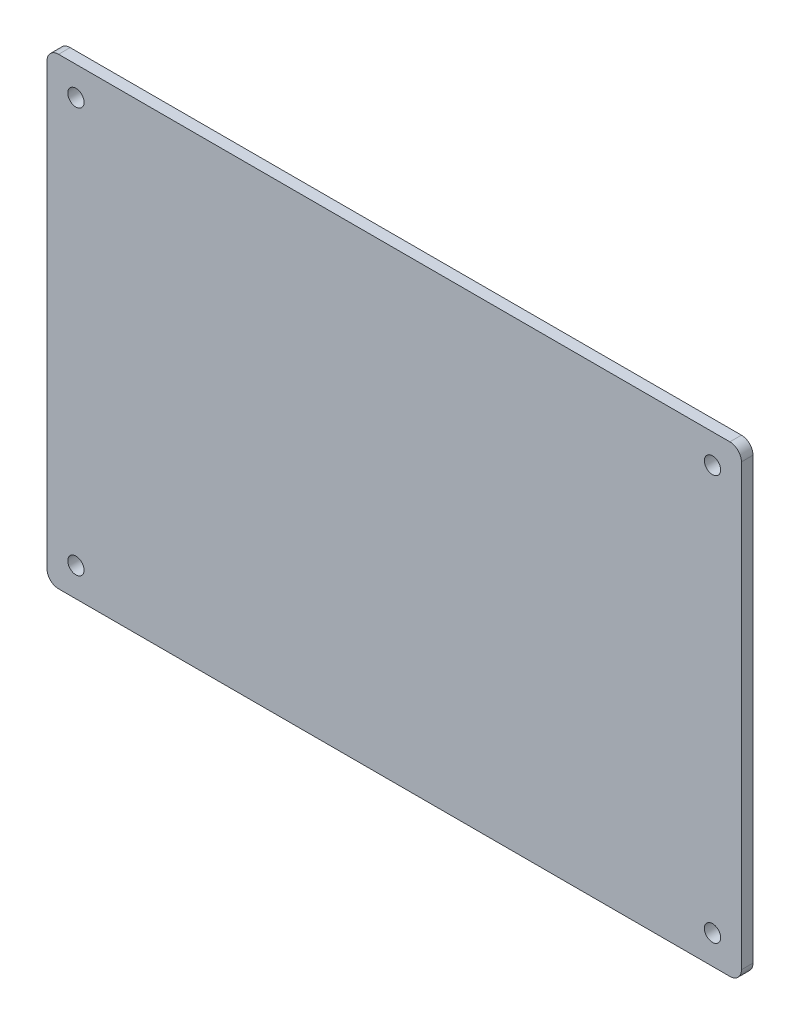
ISO-10303-21;
HEADER;
FILE_DESCRIPTION(('STEP AP214'),'2;1');
FILE_NAME('part.step','',(''),(''),'','','');
FILE_SCHEMA(('AUTOMOTIVE_DESIGN { 1 0 10303 214 1 1 1 1 }'));
ENDSEC;
DATA;
#1=APPLICATION_CONTEXT('core data for automotive mechanical design processes');
#2=APPLICATION_PROTOCOL_DEFINITION('international standard','automotive_design',2000,#1);
#3=PRODUCT_CONTEXT('',#1,'mechanical');
#4=PRODUCT('Part','Part','',(#3));
#5=PRODUCT_RELATED_PRODUCT_CATEGORY('part','',(#4));
#6=PRODUCT_DEFINITION_FORMATION('','',#4);
#7=PRODUCT_DEFINITION_CONTEXT('part definition',#1,'design');
#8=PRODUCT_DEFINITION('design','',#6,#7);
#9=PRODUCT_DEFINITION_SHAPE('','',#8);
#10=(LENGTH_UNIT() NAMED_UNIT(*) SI_UNIT(.MILLI.,.METRE.));
#11=(NAMED_UNIT(*) PLANE_ANGLE_UNIT() SI_UNIT($,.RADIAN.));
#12=(NAMED_UNIT(*) SI_UNIT($,.STERADIAN.) SOLID_ANGLE_UNIT());
#13=UNCERTAINTY_MEASURE_WITH_UNIT(LENGTH_MEASURE(1.E-05),#10,'distance_accuracy_value','');
#14=(GEOMETRIC_REPRESENTATION_CONTEXT(3) GLOBAL_UNCERTAINTY_ASSIGNED_CONTEXT((#13)) GLOBAL_UNIT_ASSIGNED_CONTEXT((#10,
#11,#12)) REPRESENTATION_CONTEXT('',''));
#15=CARTESIAN_POINT('',(0.,0.,0.));
#16=DIRECTION('',(0.,0.,1.));
#17=DIRECTION('',(1.,0.,0.));
#18=AXIS2_PLACEMENT_3D('',#15,#16,#17);
#19=CARTESIAN_POINT('',(0.,0.,2.));
#20=DIRECTION('',(0.,0.,-1.));
#21=DIRECTION('',(-1.,0.,0.));
#22=AXIS2_PLACEMENT_3D('',#19,#20,#21);
#23=PLANE('',#22);
#24=CARTESIAN_POINT('',(115.,75.,2.));
#25=DIRECTION('',(0.,0.,-1.));
#26=DIRECTION('',(-1.,0.,0.));
#27=AXIS2_PLACEMENT_3D('',#24,#25,#26);
#28=CIRCLE('',#27,1.40734065524881);
#29=CARTESIAN_POINT('',(113.592659344751,75.,2.));
#30=VERTEX_POINT('',#29);
#31=EDGE_CURVE('E189',#30,#30,#28,.T.);
#32=ORIENTED_EDGE('',*,*,#31,.T.);
#33=EDGE_LOOP('',(#32));
#34=FACE_BOUND('',#33,.T.);
#35=CARTESIAN_POINT('',(5.,5.,2.));
#36=DIRECTION('',(0.,0.,-1.));
#37=DIRECTION('',(-1.,0.,0.));
#38=AXIS2_PLACEMENT_3D('',#35,#36,#37);
#39=CIRCLE('',#38,1.4073406552488);
#40=CARTESIAN_POINT('',(3.5926593447512,5.,2.));
#41=VERTEX_POINT('',#40);
#42=EDGE_CURVE('E192',#41,#41,#39,.T.);
#43=ORIENTED_EDGE('',*,*,#42,.T.);
#44=EDGE_LOOP('',(#43));
#45=FACE_BOUND('',#44,.T.);
#46=CARTESIAN_POINT('',(115.,5.,2.));
#47=DIRECTION('',(0.,0.,1.));
#48=DIRECTION('',(1.,0.,0.));
#49=AXIS2_PLACEMENT_3D('',#46,#47,#48);
#50=CIRCLE('',#49,1.40734065524881);
#51=CARTESIAN_POINT('',(116.407340655249,5.,2.));
#52=VERTEX_POINT('',#51);
#53=EDGE_CURVE('E132',#52,#52,#50,.T.);
#54=ORIENTED_EDGE('',*,*,#53,.F.);
#55=EDGE_LOOP('',(#54));
#56=FACE_BOUND('',#55,.T.);
#57=DIRECTION('',(1.,0.,0.));
#58=VECTOR('',#57,1.);
#59=CARTESIAN_POINT('',(0.,0.,2.));
#60=LINE('',#59,#58);
#61=CARTESIAN_POINT('',(2.,0.,2.));
#62=VERTEX_POINT('',#61);
#63=CARTESIAN_POINT('',(118.,0.,2.));
#64=VERTEX_POINT('',#63);
#65=EDGE_CURVE('E119',#62,#64,#60,.T.);
#66=ORIENTED_EDGE('',*,*,#65,.T.);
#67=CARTESIAN_POINT('',(118.,2.,2.));
#68=DIRECTION('',(0.,0.,-1.));
#69=DIRECTION('',(-1.,0.,0.));
#70=AXIS2_PLACEMENT_3D('',#67,#68,#69);
#71=CIRCLE('',#70,2.);
#72=CARTESIAN_POINT('',(120.,2.,2.));
#73=VERTEX_POINT('',#72);
#74=EDGE_CURVE('E156',#64,#73,#71,.F.);
#75=ORIENTED_EDGE('',*,*,#74,.T.);
#76=DIRECTION('',(0.,1.,0.));
#77=VECTOR('',#76,1.);
#78=CARTESIAN_POINT('',(120.,0.,2.));
#79=LINE('',#78,#77);
#80=CARTESIAN_POINT('',(120.,78.,2.));
#81=VERTEX_POINT('',#80);
#82=EDGE_CURVE('E170',#73,#81,#79,.T.);
#83=ORIENTED_EDGE('',*,*,#82,.T.);
#84=CARTESIAN_POINT('',(118.,78.,2.));
#85=DIRECTION('',(0.,0.,-1.));
#86=DIRECTION('',(-1.,0.,0.));
#87=AXIS2_PLACEMENT_3D('',#84,#85,#86);
#88=CIRCLE('',#87,2.);
#89=CARTESIAN_POINT('',(118.,80.,2.));
#90=VERTEX_POINT('',#89);
#91=EDGE_CURVE('E55',#81,#90,#88,.F.);
#92=ORIENTED_EDGE('',*,*,#91,.T.);
#93=DIRECTION('',(-1.,0.,0.));
#94=VECTOR('',#93,1.);
#95=CARTESIAN_POINT('',(0.,80.,2.));
#96=LINE('',#95,#94);
#97=CARTESIAN_POINT('',(2.,80.,2.));
#98=VERTEX_POINT('',#97);
#99=EDGE_CURVE('E120',#90,#98,#96,.T.);
#100=ORIENTED_EDGE('',*,*,#99,.T.);
#101=CARTESIAN_POINT('',(2.,78.,2.));
#102=DIRECTION('',(0.,0.,-1.));
#103=DIRECTION('',(-1.,0.,0.));
#104=AXIS2_PLACEMENT_3D('',#101,#102,#103);
#105=CIRCLE('',#104,2.);
#106=CARTESIAN_POINT('',(0.,78.,2.));
#107=VERTEX_POINT('',#106);
#108=EDGE_CURVE('E153',#98,#107,#105,.F.);
#109=ORIENTED_EDGE('',*,*,#108,.T.);
#110=DIRECTION('',(0.,-1.,0.));
#111=VECTOR('',#110,1.);
#112=CARTESIAN_POINT('',(0.,0.,2.));
#113=LINE('',#112,#111);
#114=CARTESIAN_POINT('',(0.,2.,2.));
#115=VERTEX_POINT('',#114);
#116=EDGE_CURVE('E136',#107,#115,#113,.T.);
#117=ORIENTED_EDGE('',*,*,#116,.T.);
#118=CARTESIAN_POINT('',(2.,2.,2.));
#119=DIRECTION('',(0.,0.,-1.));
#120=DIRECTION('',(-1.,0.,0.));
#121=AXIS2_PLACEMENT_3D('',#118,#119,#120);
#122=CIRCLE('',#121,2.);
#123=EDGE_CURVE('E139',#115,#62,#122,.F.);
#124=ORIENTED_EDGE('',*,*,#123,.T.);
#125=EDGE_LOOP('',(#66,#75,#83,#92,#100,#109,#117,#124));
#126=FACE_BOUND('',#125,.T.);
#127=CARTESIAN_POINT('',(5.,75.,2.));
#128=DIRECTION('',(0.,0.,1.));
#129=DIRECTION('',(1.,0.,0.));
#130=AXIS2_PLACEMENT_3D('',#127,#128,#129);
#131=CIRCLE('',#130,1.4073406552488);
#132=CARTESIAN_POINT('',(6.4073406552488,75.,2.));
#133=VERTEX_POINT('',#132);
#134=EDGE_CURVE('E183',#133,#133,#131,.T.);
#135=ORIENTED_EDGE('',*,*,#134,.F.);
#136=EDGE_LOOP('',(#135));
#137=FACE_BOUND('',#136,.T.);
#138=ADVANCED_FACE('F33',(#34,#45,#56,#126,#137),#23,.F.);
#139=CARTESIAN_POINT('',(0.,0.,0.));
#140=DIRECTION('',(0.,0.,-1.));
#141=DIRECTION('',(-1.,0.,0.));
#142=AXIS2_PLACEMENT_3D('',#139,#140,#141);
#143=PLANE('',#142);
#144=CARTESIAN_POINT('',(115.,75.,0.));
#145=DIRECTION('',(0.,0.,-1.));
#146=DIRECTION('',(-1.,0.,0.));
#147=AXIS2_PLACEMENT_3D('',#144,#145,#146);
#148=CIRCLE('',#147,1.40734065524881);
#149=CARTESIAN_POINT('',(113.592659344751,75.,0.));
#150=VERTEX_POINT('',#149);
#151=EDGE_CURVE('E201',#150,#150,#148,.T.);
#152=ORIENTED_EDGE('',*,*,#151,.F.);
#153=EDGE_LOOP('',(#152));
#154=FACE_BOUND('',#153,.T.);
#155=DIRECTION('',(0.,1.,0.));
#156=VECTOR('',#155,1.);
#157=CARTESIAN_POINT('',(120.,0.,0.));
#158=LINE('',#157,#156);
#159=CARTESIAN_POINT('',(120.,2.,0.));
#160=VERTEX_POINT('',#159);
#161=CARTESIAN_POINT('',(120.,78.,0.));
#162=VERTEX_POINT('',#161);
#163=EDGE_CURVE('E126',#160,#162,#158,.T.);
#164=ORIENTED_EDGE('',*,*,#163,.F.);
#165=CARTESIAN_POINT('',(118.,2.,0.));
#166=DIRECTION('',(0.,0.,-1.));
#167=DIRECTION('',(-1.,0.,0.));
#168=AXIS2_PLACEMENT_3D('',#165,#166,#167);
#169=CIRCLE('',#168,2.);
#170=CARTESIAN_POINT('',(118.,0.,0.));
#171=VERTEX_POINT('',#170);
#172=EDGE_CURVE('E125',#160,#171,#169,.T.);
#173=ORIENTED_EDGE('',*,*,#172,.T.);
#174=DIRECTION('',(1.,0.,0.));
#175=VECTOR('',#174,1.);
#176=CARTESIAN_POINT('',(0.,0.,0.));
#177=LINE('',#176,#175);
#178=CARTESIAN_POINT('',(2.,0.,0.));
#179=VERTEX_POINT('',#178);
#180=EDGE_CURVE('E116',#179,#171,#177,.T.);
#181=ORIENTED_EDGE('',*,*,#180,.F.);
#182=CARTESIAN_POINT('',(2.,2.,0.));
#183=DIRECTION('',(0.,0.,-1.));
#184=DIRECTION('',(-1.,0.,0.));
#185=AXIS2_PLACEMENT_3D('',#182,#183,#184);
#186=CIRCLE('',#185,2.);
#187=CARTESIAN_POINT('',(0.,2.,0.));
#188=VERTEX_POINT('',#187);
#189=EDGE_CURVE('E101',#179,#188,#186,.T.);
#190=ORIENTED_EDGE('',*,*,#189,.T.);
#191=DIRECTION('',(0.,-1.,0.));
#192=VECTOR('',#191,1.);
#193=CARTESIAN_POINT('',(0.,0.,0.));
#194=LINE('',#193,#192);
#195=CARTESIAN_POINT('',(0.,78.,0.));
#196=VERTEX_POINT('',#195);
#197=EDGE_CURVE('E127',#196,#188,#194,.T.);
#198=ORIENTED_EDGE('',*,*,#197,.F.);
#199=CARTESIAN_POINT('',(2.,78.,0.));
#200=DIRECTION('',(0.,0.,-1.));
#201=DIRECTION('',(-1.,0.,0.));
#202=AXIS2_PLACEMENT_3D('',#199,#200,#201);
#203=CIRCLE('',#202,2.);
#204=CARTESIAN_POINT('',(2.,80.,0.));
#205=VERTEX_POINT('',#204);
#206=EDGE_CURVE('E146',#196,#205,#203,.T.);
#207=ORIENTED_EDGE('',*,*,#206,.T.);
#208=DIRECTION('',(-1.,0.,0.));
#209=VECTOR('',#208,1.);
#210=CARTESIAN_POINT('',(0.,80.,0.));
#211=LINE('',#210,#209);
#212=CARTESIAN_POINT('',(118.,80.,0.));
#213=VERTEX_POINT('',#212);
#214=EDGE_CURVE('E130',#213,#205,#211,.T.);
#215=ORIENTED_EDGE('',*,*,#214,.F.);
#216=CARTESIAN_POINT('',(118.,78.,0.));
#217=DIRECTION('',(0.,0.,-1.));
#218=DIRECTION('',(-1.,0.,0.));
#219=AXIS2_PLACEMENT_3D('',#216,#217,#218);
#220=CIRCLE('',#219,2.);
#221=EDGE_CURVE('E148',#213,#162,#220,.T.);
#222=ORIENTED_EDGE('',*,*,#221,.T.);
#223=EDGE_LOOP('',(#164,#173,#181,#190,#198,#207,#215,#222));
#224=FACE_BOUND('',#223,.T.);
#225=CARTESIAN_POINT('',(115.,5.,0.));
#226=DIRECTION('',(0.,0.,1.));
#227=DIRECTION('',(1.,0.,0.));
#228=AXIS2_PLACEMENT_3D('',#225,#226,#227);
#229=CIRCLE('',#228,1.40734065524881);
#230=CARTESIAN_POINT('',(116.407340655249,5.,0.));
#231=VERTEX_POINT('',#230);
#232=EDGE_CURVE('E173',#231,#231,#229,.T.);
#233=ORIENTED_EDGE('',*,*,#232,.T.);
#234=EDGE_LOOP('',(#233));
#235=FACE_BOUND('',#234,.T.);
#236=CARTESIAN_POINT('',(5.,5.,0.));
#237=DIRECTION('',(0.,0.,-1.));
#238=DIRECTION('',(-1.,0.,0.));
#239=AXIS2_PLACEMENT_3D('',#236,#237,#238);
#240=CIRCLE('',#239,1.4073406552488);
#241=CARTESIAN_POINT('',(3.5926593447512,5.,0.));
#242=VERTEX_POINT('',#241);
#243=EDGE_CURVE('E186',#242,#242,#240,.T.);
#244=ORIENTED_EDGE('',*,*,#243,.F.);
#245=EDGE_LOOP('',(#244));
#246=FACE_BOUND('',#245,.T.);
#247=CARTESIAN_POINT('',(5.,75.,0.));
#248=DIRECTION('',(0.,0.,1.));
#249=DIRECTION('',(1.,0.,0.));
#250=AXIS2_PLACEMENT_3D('',#247,#248,#249);
#251=CIRCLE('',#250,1.4073406552488);
#252=CARTESIAN_POINT('',(6.4073406552488,75.,0.));
#253=VERTEX_POINT('',#252);
#254=EDGE_CURVE('E185',#253,#253,#251,.T.);
#255=ORIENTED_EDGE('',*,*,#254,.T.);
#256=EDGE_LOOP('',(#255));
#257=FACE_BOUND('',#256,.T.);
#258=ADVANCED_FACE('F123',(#154,#224,#235,#246,#257),#143,.T.);
#259=CARTESIAN_POINT('',(0.,0.,2.));
#260=DIRECTION('',(1.,0.,0.));
#261=DIRECTION('',(0.,0.,-1.));
#262=AXIS2_PLACEMENT_3D('',#259,#260,#261);
#263=PLANE('',#262);
#264=ORIENTED_EDGE('',*,*,#116,.F.);
#265=DIRECTION('',(0.,0.,-1.));
#266=VECTOR('',#265,1.);
#267=CARTESIAN_POINT('',(0.,78.,2.));
#268=LINE('',#267,#266);
#269=EDGE_CURVE('E11',#107,#196,#268,.T.);
#270=ORIENTED_EDGE('',*,*,#269,.T.);
#271=ORIENTED_EDGE('',*,*,#197,.T.);
#272=DIRECTION('',(0.,0.,-1.));
#273=VECTOR('',#272,1.);
#274=CARTESIAN_POINT('',(0.,2.,2.));
#275=LINE('',#274,#273);
#276=EDGE_CURVE('E107',#188,#115,#275,.F.);
#277=ORIENTED_EDGE('',*,*,#276,.T.);
#278=EDGE_LOOP('',(#264,#270,#271,#277));
#279=FACE_BOUND('',#278,.T.);
#280=ADVANCED_FACE('F168',(#279),#263,.F.);
#281=CARTESIAN_POINT('',(0.,0.,2.));
#282=DIRECTION('',(0.,1.,0.));
#283=DIRECTION('',(0.,0.,1.));
#284=AXIS2_PLACEMENT_3D('',#281,#282,#283);
#285=PLANE('',#284);
#286=ORIENTED_EDGE('',*,*,#180,.T.);
#287=DIRECTION('',(0.,0.,-1.));
#288=VECTOR('',#287,1.);
#289=CARTESIAN_POINT('',(118.,0.,2.));
#290=LINE('',#289,#288);
#291=EDGE_CURVE('E151',#171,#64,#290,.F.);
#292=ORIENTED_EDGE('',*,*,#291,.T.);
#293=ORIENTED_EDGE('',*,*,#65,.F.);
#294=DIRECTION('',(0.,0.,-1.));
#295=VECTOR('',#294,1.);
#296=CARTESIAN_POINT('',(2.,0.,2.));
#297=LINE('',#296,#295);
#298=EDGE_CURVE('E105',#62,#179,#297,.T.);
#299=ORIENTED_EDGE('',*,*,#298,.T.);
#300=EDGE_LOOP('',(#286,#292,#293,#299));
#301=FACE_BOUND('',#300,.T.);
#302=ADVANCED_FACE('F115',(#301),#285,.F.);
#303=CARTESIAN_POINT('',(120.,0.,2.));
#304=DIRECTION('',(-1.,0.,0.));
#305=DIRECTION('',(0.,0.,1.));
#306=AXIS2_PLACEMENT_3D('',#303,#304,#305);
#307=PLANE('',#306);
#308=ORIENTED_EDGE('',*,*,#82,.F.);
#309=DIRECTION('',(0.,0.,-1.));
#310=VECTOR('',#309,1.);
#311=CARTESIAN_POINT('',(120.,2.,2.));
#312=LINE('',#311,#310);
#313=EDGE_CURVE('E143',#73,#160,#312,.T.);
#314=ORIENTED_EDGE('',*,*,#313,.T.);
#315=ORIENTED_EDGE('',*,*,#163,.T.);
#316=DIRECTION('',(0.,0.,-1.));
#317=VECTOR('',#316,1.);
#318=CARTESIAN_POINT('',(120.,78.,2.));
#319=LINE('',#318,#317);
#320=EDGE_CURVE('E141',#162,#81,#319,.F.);
#321=ORIENTED_EDGE('',*,*,#320,.T.);
#322=EDGE_LOOP('',(#308,#314,#315,#321));
#323=FACE_BOUND('',#322,.T.);
#324=ADVANCED_FACE('F232',(#323),#307,.F.);
#325=CARTESIAN_POINT('',(0.,80.,2.));
#326=DIRECTION('',(0.,-1.,0.));
#327=DIRECTION('',(0.,0.,-1.));
#328=AXIS2_PLACEMENT_3D('',#325,#326,#327);
#329=PLANE('',#328);
#330=ORIENTED_EDGE('',*,*,#99,.F.);
#331=DIRECTION('',(0.,0.,-1.));
#332=VECTOR('',#331,1.);
#333=CARTESIAN_POINT('',(118.,80.,2.));
#334=LINE('',#333,#332);
#335=EDGE_CURVE('E41',#90,#213,#334,.T.);
#336=ORIENTED_EDGE('',*,*,#335,.T.);
#337=ORIENTED_EDGE('',*,*,#214,.T.);
#338=DIRECTION('',(0.,0.,-1.));
#339=VECTOR('',#338,1.);
#340=CARTESIAN_POINT('',(2.,80.,2.));
#341=LINE('',#340,#339);
#342=EDGE_CURVE('E48',#205,#98,#341,.F.);
#343=ORIENTED_EDGE('',*,*,#342,.T.);
#344=EDGE_LOOP('',(#330,#336,#337,#343));
#345=FACE_BOUND('',#344,.T.);
#346=ADVANCED_FACE('F161',(#345),#329,.F.);
#347=CARTESIAN_POINT('',(2.,2.,2.));
#348=DIRECTION('',(0.,0.,-1.));
#349=DIRECTION('',(-1.,0.,0.));
#350=AXIS2_PLACEMENT_3D('',#347,#348,#349);
#351=CYLINDRICAL_SURFACE('',#350,2.);
#352=ORIENTED_EDGE('',*,*,#123,.F.);
#353=ORIENTED_EDGE('',*,*,#276,.F.);
#354=ORIENTED_EDGE('',*,*,#189,.F.);
#355=ORIENTED_EDGE('',*,*,#298,.F.);
#356=EDGE_LOOP('',(#352,#353,#354,#355));
#357=FACE_BOUND('',#356,.T.);
#358=ADVANCED_FACE('F104',(#357),#351,.T.);
#359=CARTESIAN_POINT('',(118.,2.,2.));
#360=DIRECTION('',(0.,0.,-1.));
#361=DIRECTION('',(-1.,0.,0.));
#362=AXIS2_PLACEMENT_3D('',#359,#360,#361);
#363=CYLINDRICAL_SURFACE('',#362,2.);
#364=ORIENTED_EDGE('',*,*,#74,.F.);
#365=ORIENTED_EDGE('',*,*,#291,.F.);
#366=ORIENTED_EDGE('',*,*,#172,.F.);
#367=ORIENTED_EDGE('',*,*,#313,.F.);
#368=EDGE_LOOP('',(#364,#365,#366,#367));
#369=FACE_BOUND('',#368,.T.);
#370=ADVANCED_FACE('F242',(#369),#363,.T.);
#371=CARTESIAN_POINT('',(118.,78.,2.));
#372=DIRECTION('',(0.,0.,-1.));
#373=DIRECTION('',(-1.,0.,0.));
#374=AXIS2_PLACEMENT_3D('',#371,#372,#373);
#375=CYLINDRICAL_SURFACE('',#374,2.);
#376=ORIENTED_EDGE('',*,*,#91,.F.);
#377=ORIENTED_EDGE('',*,*,#320,.F.);
#378=ORIENTED_EDGE('',*,*,#221,.F.);
#379=ORIENTED_EDGE('',*,*,#335,.F.);
#380=EDGE_LOOP('',(#376,#377,#378,#379));
#381=FACE_BOUND('',#380,.T.);
#382=ADVANCED_FACE('F244',(#381),#375,.T.);
#383=CARTESIAN_POINT('',(2.,78.,2.));
#384=DIRECTION('',(0.,0.,-1.));
#385=DIRECTION('',(-1.,0.,0.));
#386=AXIS2_PLACEMENT_3D('',#383,#384,#385);
#387=CYLINDRICAL_SURFACE('',#386,2.);
#388=ORIENTED_EDGE('',*,*,#108,.F.);
#389=ORIENTED_EDGE('',*,*,#342,.F.);
#390=ORIENTED_EDGE('',*,*,#206,.F.);
#391=ORIENTED_EDGE('',*,*,#269,.F.);
#392=EDGE_LOOP('',(#388,#389,#390,#391));
#393=FACE_BOUND('',#392,.T.);
#394=ADVANCED_FACE('F35',(#393),#387,.T.);
#395=CARTESIAN_POINT('',(115.,5.,2.));
#396=DIRECTION('',(0.,0.,-1.));
#397=DIRECTION('',(-1.,0.,0.));
#398=AXIS2_PLACEMENT_3D('',#395,#396,#397);
#399=CYLINDRICAL_SURFACE('',#398,1.40734065524881);
#400=ORIENTED_EDGE('',*,*,#53,.T.);
#401=EDGE_LOOP('',(#400));
#402=FACE_BOUND('',#401,.T.);
#403=ORIENTED_EDGE('',*,*,#232,.F.);
#404=EDGE_LOOP('',(#403));
#405=FACE_BOUND('',#404,.T.);
#406=ADVANCED_FACE('F223',(#402,#405),#399,.F.);
#407=CARTESIAN_POINT('',(5.,5.,2.));
#408=DIRECTION('',(0.,0.,-1.));
#409=DIRECTION('',(-1.,0.,0.));
#410=AXIS2_PLACEMENT_3D('',#407,#408,#409);
#411=CYLINDRICAL_SURFACE('',#410,1.4073406552488);
#412=ORIENTED_EDGE('',*,*,#42,.F.);
#413=EDGE_LOOP('',(#412));
#414=FACE_BOUND('',#413,.T.);
#415=ORIENTED_EDGE('',*,*,#243,.T.);
#416=EDGE_LOOP('',(#415));
#417=FACE_BOUND('',#416,.T.);
#418=ADVANCED_FACE('F218',(#414,#417),#411,.F.);
#419=CARTESIAN_POINT('',(5.,75.,2.));
#420=DIRECTION('',(0.,0.,-1.));
#421=DIRECTION('',(-1.,0.,0.));
#422=AXIS2_PLACEMENT_3D('',#419,#420,#421);
#423=CYLINDRICAL_SURFACE('',#422,1.4073406552488);
#424=ORIENTED_EDGE('',*,*,#134,.T.);
#425=EDGE_LOOP('',(#424));
#426=FACE_BOUND('',#425,.T.);
#427=ORIENTED_EDGE('',*,*,#254,.F.);
#428=EDGE_LOOP('',(#427));
#429=FACE_BOUND('',#428,.T.);
#430=ADVANCED_FACE('F213',(#426,#429),#423,.F.);
#431=CARTESIAN_POINT('',(115.,75.,2.));
#432=DIRECTION('',(0.,0.,-1.));
#433=DIRECTION('',(-1.,0.,0.));
#434=AXIS2_PLACEMENT_3D('',#431,#432,#433);
#435=CYLINDRICAL_SURFACE('',#434,1.40734065524881);
#436=ORIENTED_EDGE('',*,*,#31,.F.);
#437=EDGE_LOOP('',(#436));
#438=FACE_BOUND('',#437,.T.);
#439=ORIENTED_EDGE('',*,*,#151,.T.);
#440=EDGE_LOOP('',(#439));
#441=FACE_BOUND('',#440,.T.);
#442=ADVANCED_FACE('F211',(#438,#441),#435,.F.);
#443=CLOSED_SHELL('',(#138,#258,#280,#302,#324,#346,#358,#370,#382,#394,#406,#418,#430,#442));
#444=MANIFOLD_SOLID_BREP('B2',#443);
#445=ADVANCED_BREP_SHAPE_REPRESENTATION('',(#18,#444),#14);
#446=SHAPE_DEFINITION_REPRESENTATION(#9,#445);
ENDSEC;
END-ISO-10303-21;
